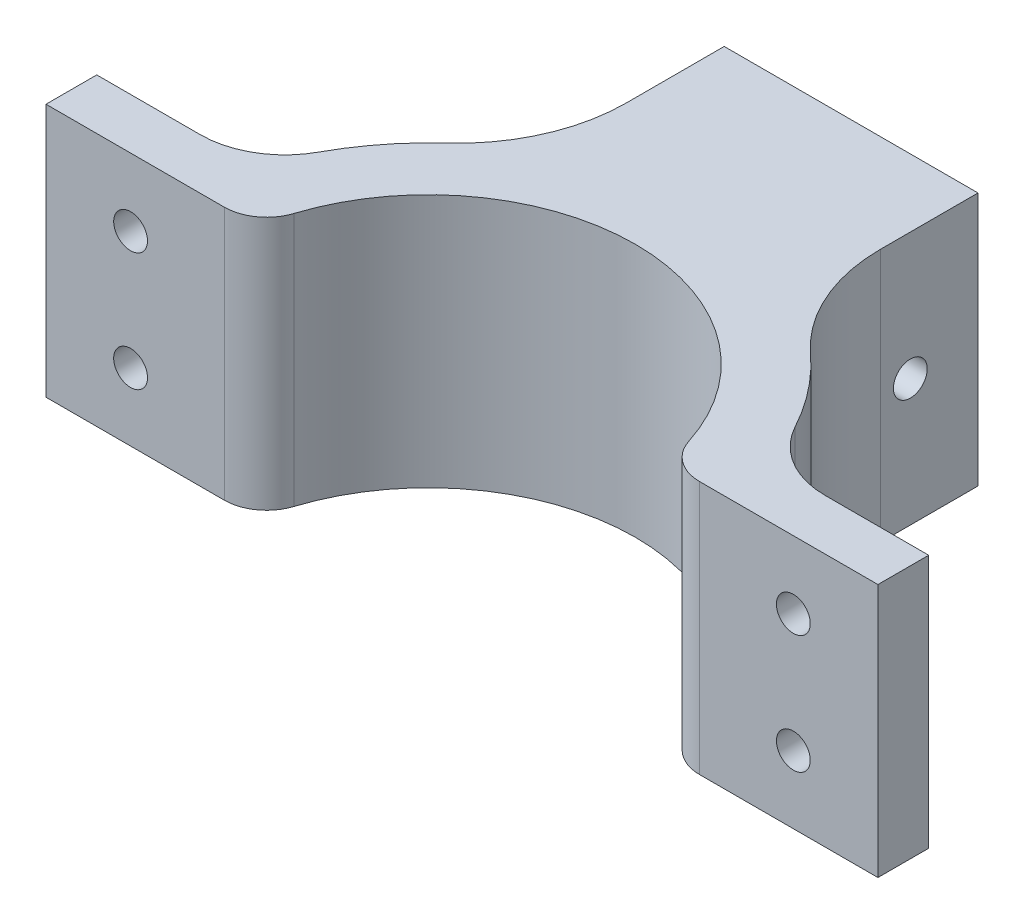
ISO-10303-21;
HEADER;
FILE_DESCRIPTION(('STEP AP214'),'2;1');
FILE_NAME('part.step','',(''),(''),'','','');
FILE_SCHEMA(('AUTOMOTIVE_DESIGN { 1 0 10303 214 1 1 1 1 }'));
ENDSEC;
DATA;
#1=APPLICATION_CONTEXT('core data for automotive mechanical design processes');
#2=APPLICATION_PROTOCOL_DEFINITION('international standard','automotive_design',2000,#1);
#3=PRODUCT_CONTEXT('',#1,'mechanical');
#4=PRODUCT('Part','Part','',(#3));
#5=PRODUCT_RELATED_PRODUCT_CATEGORY('part','',(#4));
#6=PRODUCT_DEFINITION_FORMATION('','',#4);
#7=PRODUCT_DEFINITION_CONTEXT('part definition',#1,'design');
#8=PRODUCT_DEFINITION('design','',#6,#7);
#9=PRODUCT_DEFINITION_SHAPE('','',#8);
#10=(LENGTH_UNIT() NAMED_UNIT(*) SI_UNIT(.MILLI.,.METRE.));
#11=(NAMED_UNIT(*) PLANE_ANGLE_UNIT() SI_UNIT($,.RADIAN.));
#12=(NAMED_UNIT(*) SI_UNIT($,.STERADIAN.) SOLID_ANGLE_UNIT());
#13=UNCERTAINTY_MEASURE_WITH_UNIT(LENGTH_MEASURE(1.E-05),#10,'distance_accuracy_value','');
#14=(GEOMETRIC_REPRESENTATION_CONTEXT(3) GLOBAL_UNCERTAINTY_ASSIGNED_CONTEXT((#13)) GLOBAL_UNIT_ASSIGNED_CONTEXT((#10,
#11,#12)) REPRESENTATION_CONTEXT('',''));
#15=CARTESIAN_POINT('',(0.,0.,0.));
#16=DIRECTION('',(0.,0.,1.));
#17=DIRECTION('',(1.,0.,0.));
#18=AXIS2_PLACEMENT_3D('',#15,#16,#17);
#19=CARTESIAN_POINT('',(0.,30.,0.));
#20=DIRECTION('',(0.,-1.,0.));
#21=DIRECTION('',(0.,0.,-1.));
#22=AXIS2_PLACEMENT_3D('',#19,#20,#21);
#23=CYLINDRICAL_SURFACE('',#22,32.);
#24=CARTESIAN_POINT('',(0.,30.,0.));
#25=DIRECTION('',(0.,1.,0.));
#26=DIRECTION('',(0.,0.,1.));
#27=AXIS2_PLACEMENT_3D('',#24,#25,#26);
#28=CIRCLE('',#27,32.);
#29=CARTESIAN_POINT('',(-21.5384615384615,30.,-23.6663194129593));
#30=VERTEX_POINT('',#29);
#31=CARTESIAN_POINT('',(-28.138949047801,30.,-15.2380952380952));
#32=VERTEX_POINT('',#31);
#33=EDGE_CURVE('E281',#30,#32,#28,.T.);
#34=ORIENTED_EDGE('',*,*,#33,.F.);
#35=DIRECTION('',(0.,-1.,0.));
#36=VECTOR('',#35,1.);
#37=CARTESIAN_POINT('',(-21.5384615384615,30.,-23.6663194129593));
#38=LINE('',#37,#36);
#39=CARTESIAN_POINT('',(-21.5384615384615,0.,-23.6663194129593));
#40=VERTEX_POINT('',#39);
#41=EDGE_CURVE('E62',#30,#40,#38,.T.);
#42=ORIENTED_EDGE('',*,*,#41,.T.);
#43=CARTESIAN_POINT('',(0.,0.,0.));
#44=DIRECTION('',(0.,1.,0.));
#45=DIRECTION('',(0.,0.,1.));
#46=AXIS2_PLACEMENT_3D('',#43,#44,#45);
#47=CIRCLE('',#46,32.);
#48=CARTESIAN_POINT('',(-28.138949047801,0.,-15.2380952380952));
#49=VERTEX_POINT('',#48);
#50=EDGE_CURVE('E302',#40,#49,#47,.T.);
#51=ORIENTED_EDGE('',*,*,#50,.T.);
#52=DIRECTION('',(0.,-1.,0.));
#53=VECTOR('',#52,1.);
#54=CARTESIAN_POINT('',(-28.138949047801,30.,-15.2380952380952));
#55=LINE('',#54,#53);
#56=EDGE_CURVE('E323',#49,#32,#55,.F.);
#57=ORIENTED_EDGE('',*,*,#56,.T.);
#58=EDGE_LOOP('',(#34,#42,#51,#57));
#59=FACE_BOUND('',#58,.T.);
#60=ADVANCED_FACE('F41',(#59),#23,.T.);
#61=CARTESIAN_POINT('',(28.138949047801,0.,-15.2380952380952));
#62=VERTEX_POINT('',#61);
#63=CARTESIAN_POINT('',(21.5384615384615,0.,-23.6663194129593));
#64=VERTEX_POINT('',#63);
#65=EDGE_CURVE('E303',#62,#64,#47,.T.);
#66=ORIENTED_EDGE('',*,*,#65,.T.);
#67=DIRECTION('',(0.,-1.,0.));
#68=VECTOR('',#67,1.);
#69=CARTESIAN_POINT('',(21.5384615384615,30.,-23.6663194129593));
#70=LINE('',#69,#68);
#71=CARTESIAN_POINT('',(21.5384615384615,30.,-23.6663194129593));
#72=VERTEX_POINT('',#71);
#73=EDGE_CURVE('E373',#64,#72,#70,.F.);
#74=ORIENTED_EDGE('',*,*,#73,.T.);
#75=CARTESIAN_POINT('',(28.138949047801,30.,-15.2380952380952));
#76=VERTEX_POINT('',#75);
#77=EDGE_CURVE('E282',#76,#72,#28,.T.);
#78=ORIENTED_EDGE('',*,*,#77,.F.);
#79=DIRECTION('',(0.,-1.,0.));
#80=VECTOR('',#79,1.);
#81=CARTESIAN_POINT('',(28.138949047801,30.,-15.2380952380952));
#82=LINE('',#81,#80);
#83=EDGE_CURVE('E326',#76,#62,#82,.T.);
#84=ORIENTED_EDGE('',*,*,#83,.T.);
#85=EDGE_LOOP('',(#66,#74,#78,#84));
#86=FACE_BOUND('',#85,.T.);
#87=ADVANCED_FACE('F399',(#86),#23,.T.);
#88=CARTESIAN_POINT('',(0.,30.,0.));
#89=DIRECTION('',(0.,-1.,0.));
#90=DIRECTION('',(0.,0.,-1.));
#91=AXIS2_PLACEMENT_3D('',#88,#89,#90);
#92=CYLINDRICAL_SURFACE('',#91,24.5);
#93=CARTESIAN_POINT('',(0.,30.,0.));
#94=DIRECTION('',(0.,1.,0.));
#95=DIRECTION('',(0.,0.,1.));
#96=AXIS2_PLACEMENT_3D('',#93,#94,#95);
#97=CIRCLE('',#96,24.5);
#98=CARTESIAN_POINT('',(23.3319675459704,30.,-7.47457627118644));
#99=VERTEX_POINT('',#98);
#100=CARTESIAN_POINT('',(-23.3319675459704,30.,-7.47457627118644));
#101=VERTEX_POINT('',#100);
#102=EDGE_CURVE('E270',#99,#101,#97,.T.);
#103=ORIENTED_EDGE('',*,*,#102,.T.);
#104=DIRECTION('',(0.,-1.,0.));
#105=VECTOR('',#104,1.);
#106=CARTESIAN_POINT('',(-23.3319675459704,30.,-7.47457627118644));
#107=LINE('',#106,#105);
#108=CARTESIAN_POINT('',(-23.3319675459704,0.,-7.47457627118644));
#109=VERTEX_POINT('',#108);
#110=EDGE_CURVE('E345',#101,#109,#107,.T.);
#111=ORIENTED_EDGE('',*,*,#110,.T.);
#112=CARTESIAN_POINT('',(0.,0.,0.));
#113=DIRECTION('',(0.,1.,0.));
#114=DIRECTION('',(0.,0.,1.));
#115=AXIS2_PLACEMENT_3D('',#112,#113,#114);
#116=CIRCLE('',#115,24.5);
#117=CARTESIAN_POINT('',(23.3319675459704,0.,-7.47457627118644));
#118=VERTEX_POINT('',#117);
#119=EDGE_CURVE('E267',#118,#109,#116,.T.);
#120=ORIENTED_EDGE('',*,*,#119,.F.);
#121=DIRECTION('',(0.,-1.,0.));
#122=VECTOR('',#121,1.);
#123=CARTESIAN_POINT('',(23.3319675459704,30.,-7.47457627118644));
#124=LINE('',#123,#122);
#125=EDGE_CURVE('E343',#118,#99,#124,.F.);
#126=ORIENTED_EDGE('',*,*,#125,.T.);
#127=EDGE_LOOP('',(#103,#111,#120,#126));
#128=FACE_BOUND('',#127,.T.);
#129=ADVANCED_FACE('F427',(#128),#92,.F.);
#130=CARTESIAN_POINT('',(0.,30.,-4.));
#131=DIRECTION('',(0.,0.,-1.));
#132=DIRECTION('',(-1.,0.,0.));
#133=AXIS2_PLACEMENT_3D('',#130,#131,#132);
#134=PLANE('',#133);
#135=CARTESIAN_POINT('',(39.1712639305436,8.,-3.99999999999997));
#136=DIRECTION('',(0.,0.,-1.));
#137=DIRECTION('',(-1.,0.,0.));
#138=AXIS2_PLACEMENT_3D('',#135,#136,#137);
#139=CIRCLE('',#138,2.);
#140=CARTESIAN_POINT('',(37.1712639305436,8.,-3.99999999999997));
#141=VERTEX_POINT('',#140);
#142=EDGE_CURVE('E246',#141,#141,#139,.T.);
#143=ORIENTED_EDGE('',*,*,#142,.T.);
#144=EDGE_LOOP('',(#143));
#145=FACE_BOUND('',#144,.T.);
#146=CARTESIAN_POINT('',(39.1712639305436,22.,-3.99999999999997));
#147=DIRECTION('',(0.,0.,-1.));
#148=DIRECTION('',(-1.,0.,0.));
#149=AXIS2_PLACEMENT_3D('',#146,#147,#148);
#150=CIRCLE('',#149,2.);
#151=CARTESIAN_POINT('',(37.1712639305436,22.,-3.99999999999997));
#152=VERTEX_POINT('',#151);
#153=EDGE_CURVE('E264',#152,#152,#150,.T.);
#154=ORIENTED_EDGE('',*,*,#153,.T.);
#155=EDGE_LOOP('',(#154));
#156=FACE_BOUND('',#155,.T.);
#157=DIRECTION('',(1.,0.,0.));
#158=VECTOR('',#157,1.);
#159=CARTESIAN_POINT('',(0.,30.,-4.));
#160=LINE('',#159,#158);
#161=CARTESIAN_POINT('',(28.0935935757603,30.,-4.));
#162=VERTEX_POINT('',#161);
#163=CARTESIAN_POINT('',(49.1712639305436,30.,-3.99999999999999));
#164=VERTEX_POINT('',#163);
#165=EDGE_CURVE('E273',#162,#164,#160,.T.);
#166=ORIENTED_EDGE('',*,*,#165,.F.);
#167=DIRECTION('',(0.,1.,0.));
#168=VECTOR('',#167,1.);
#169=CARTESIAN_POINT('',(28.0935935757603,0.,-4.));
#170=LINE('',#169,#168);
#171=CARTESIAN_POINT('',(28.0935935757603,0.,-4.));
#172=VERTEX_POINT('',#171);
#173=EDGE_CURVE('E358',#162,#172,#170,.F.);
#174=ORIENTED_EDGE('',*,*,#173,.T.);
#175=DIRECTION('',(1.,0.,0.));
#176=VECTOR('',#175,1.);
#177=CARTESIAN_POINT('',(0.,0.,-4.));
#178=LINE('',#177,#176);
#179=CARTESIAN_POINT('',(49.1712639305436,0.,-3.99999999999999));
#180=VERTEX_POINT('',#179);
#181=EDGE_CURVE('E295',#172,#180,#178,.T.);
#182=ORIENTED_EDGE('',*,*,#181,.T.);
#183=DIRECTION('',(0.,-1.,0.));
#184=VECTOR('',#183,1.);
#185=CARTESIAN_POINT('',(49.1712639305436,30.,-3.99999999999999));
#186=LINE('',#185,#184);
#187=EDGE_CURVE('E320',#164,#180,#186,.T.);
#188=ORIENTED_EDGE('',*,*,#187,.F.);
#189=EDGE_LOOP('',(#166,#174,#182,#188));
#190=FACE_BOUND('',#189,.T.);
#191=ADVANCED_FACE('F419',(#145,#156,#190),#134,.F.);
#192=CARTESIAN_POINT('',(49.1712639305436,30.,0.));
#193=DIRECTION('',(-1.,0.,0.));
#194=DIRECTION('',(0.,0.,1.));
#195=AXIS2_PLACEMENT_3D('',#192,#193,#194);
#196=PLANE('',#195);
#197=DIRECTION('',(0.,0.,-1.));
#198=VECTOR('',#197,1.);
#199=CARTESIAN_POINT('',(49.1712639305436,0.,0.));
#200=LINE('',#199,#198);
#201=CARTESIAN_POINT('',(49.1712639305436,0.,-9.99999999999999));
#202=VERTEX_POINT('',#201);
#203=EDGE_CURVE('E297',#180,#202,#200,.T.);
#204=ORIENTED_EDGE('',*,*,#203,.T.);
#205=DIRECTION('',(0.,-1.,0.));
#206=VECTOR('',#205,1.);
#207=CARTESIAN_POINT('',(49.1712639305436,30.,-9.99999999999999));
#208=LINE('',#207,#206);
#209=CARTESIAN_POINT('',(49.1712639305436,30.,-9.99999999999999));
#210=VERTEX_POINT('',#209);
#211=EDGE_CURVE('E317',#210,#202,#208,.T.);
#212=ORIENTED_EDGE('',*,*,#211,.F.);
#213=DIRECTION('',(0.,0.,-1.));
#214=VECTOR('',#213,1.);
#215=CARTESIAN_POINT('',(49.1712639305436,30.,0.));
#216=LINE('',#215,#214);
#217=EDGE_CURVE('E276',#164,#210,#216,.T.);
#218=ORIENTED_EDGE('',*,*,#217,.F.);
#219=ORIENTED_EDGE('',*,*,#187,.T.);
#220=EDGE_LOOP('',(#204,#212,#218,#219));
#221=FACE_BOUND('',#220,.T.);
#222=ADVANCED_FACE('F413',(#221),#196,.F.);
#223=CARTESIAN_POINT('',(0.,30.,-10.));
#224=DIRECTION('',(0.,0.,-1.));
#225=DIRECTION('',(-1.,0.,0.));
#226=AXIS2_PLACEMENT_3D('',#223,#224,#225);
#227=PLANE('',#226);
#228=CARTESIAN_POINT('',(39.1712639305436,8.,-9.99999999999999));
#229=DIRECTION('',(0.,0.,-1.));
#230=DIRECTION('',(-1.,0.,0.));
#231=AXIS2_PLACEMENT_3D('',#228,#229,#230);
#232=CIRCLE('',#231,2.);
#233=CARTESIAN_POINT('',(37.1712639305436,8.,-9.99999999999999));
#234=VERTEX_POINT('',#233);
#235=EDGE_CURVE('E250',#234,#234,#232,.T.);
#236=ORIENTED_EDGE('',*,*,#235,.F.);
#237=EDGE_LOOP('',(#236));
#238=FACE_BOUND('',#237,.T.);
#239=CARTESIAN_POINT('',(39.1712639305436,22.,-9.99999999999999));
#240=DIRECTION('',(0.,0.,-1.));
#241=DIRECTION('',(-1.,0.,0.));
#242=AXIS2_PLACEMENT_3D('',#239,#240,#241);
#243=CIRCLE('',#242,2.);
#244=CARTESIAN_POINT('',(37.1712639305436,22.,-9.99999999999999));
#245=VERTEX_POINT('',#244);
#246=EDGE_CURVE('E249',#245,#245,#243,.T.);
#247=ORIENTED_EDGE('',*,*,#246,.F.);
#248=EDGE_LOOP('',(#247));
#249=FACE_BOUND('',#248,.T.);
#250=DIRECTION('',(1.,0.,0.));
#251=VECTOR('',#250,1.);
#252=CARTESIAN_POINT('',(0.,0.,-10.));
#253=LINE('',#252,#251);
#254=CARTESIAN_POINT('',(36.9323706252388,0.,-9.99999999999999));
#255=VERTEX_POINT('',#254);
#256=EDGE_CURVE('E300',#255,#202,#253,.T.);
#257=ORIENTED_EDGE('',*,*,#256,.F.);
#258=DIRECTION('',(0.,-1.,0.));
#259=VECTOR('',#258,1.);
#260=CARTESIAN_POINT('',(36.9323706252388,30.,-9.99999999999999));
#261=LINE('',#260,#259);
#262=CARTESIAN_POINT('',(36.9323706252388,30.,-9.99999999999999));
#263=VERTEX_POINT('',#262);
#264=EDGE_CURVE('E329',#255,#263,#261,.F.);
#265=ORIENTED_EDGE('',*,*,#264,.T.);
#266=DIRECTION('',(1.,0.,0.));
#267=VECTOR('',#266,1.);
#268=CARTESIAN_POINT('',(0.,30.,-10.));
#269=LINE('',#268,#267);
#270=EDGE_CURVE('E279',#263,#210,#269,.T.);
#271=ORIENTED_EDGE('',*,*,#270,.T.);
#272=ORIENTED_EDGE('',*,*,#211,.T.);
#273=EDGE_LOOP('',(#257,#265,#271,#272));
#274=FACE_BOUND('',#273,.T.);
#275=ADVANCED_FACE('F408',(#238,#249,#274),#227,.T.);
#276=CARTESIAN_POINT('',(0.,30.,-10.));
#277=DIRECTION('',(0.,0.,1.));
#278=DIRECTION('',(1.,0.,0.));
#279=AXIS2_PLACEMENT_3D('',#276,#277,#278);
#280=PLANE('',#279);
#281=CARTESIAN_POINT('',(-39.1712639305436,22.,-10.));
#282=DIRECTION('',(0.,0.,-1.));
#283=DIRECTION('',(1.,0.,0.));
#284=AXIS2_PLACEMENT_3D('',#281,#282,#283);
#285=CIRCLE('',#284,2.);
#286=CARTESIAN_POINT('',(-37.1712639305436,22.,-10.));
#287=VERTEX_POINT('',#286);
#288=EDGE_CURVE('E245',#287,#287,#285,.T.);
#289=ORIENTED_EDGE('',*,*,#288,.F.);
#290=EDGE_LOOP('',(#289));
#291=FACE_BOUND('',#290,.T.);
#292=CARTESIAN_POINT('',(-39.1712639305436,8.,-10.));
#293=DIRECTION('',(0.,0.,-1.));
#294=DIRECTION('',(1.,0.,0.));
#295=AXIS2_PLACEMENT_3D('',#292,#293,#294);
#296=CIRCLE('',#295,2.);
#297=CARTESIAN_POINT('',(-37.1712639305436,8.,-10.));
#298=VERTEX_POINT('',#297);
#299=EDGE_CURVE('E256',#298,#298,#296,.T.);
#300=ORIENTED_EDGE('',*,*,#299,.F.);
#301=EDGE_LOOP('',(#300));
#302=FACE_BOUND('',#301,.T.);
#303=DIRECTION('',(-1.,0.,0.));
#304=VECTOR('',#303,1.);
#305=CARTESIAN_POINT('',(0.,30.,-10.));
#306=LINE('',#305,#304);
#307=CARTESIAN_POINT('',(-36.9323706252388,30.,-9.99999999999999));
#308=VERTEX_POINT('',#307);
#309=CARTESIAN_POINT('',(-49.1712639305436,30.,-9.99999999999999));
#310=VERTEX_POINT('',#309);
#311=EDGE_CURVE('E285',#308,#310,#306,.T.);
#312=ORIENTED_EDGE('',*,*,#311,.F.);
#313=DIRECTION('',(0.,1.,0.));
#314=VECTOR('',#313,1.);
#315=CARTESIAN_POINT('',(-36.9323706252388,0.,-9.99999999999999));
#316=LINE('',#315,#314);
#317=CARTESIAN_POINT('',(-36.9323706252388,0.,-9.99999999999999));
#318=VERTEX_POINT('',#317);
#319=EDGE_CURVE('E331',#308,#318,#316,.F.);
#320=ORIENTED_EDGE('',*,*,#319,.T.);
#321=DIRECTION('',(-1.,0.,0.));
#322=VECTOR('',#321,1.);
#323=CARTESIAN_POINT('',(0.,0.,-10.));
#324=LINE('',#323,#322);
#325=CARTESIAN_POINT('',(-49.1712639305436,0.,-9.99999999999999));
#326=VERTEX_POINT('',#325);
#327=EDGE_CURVE('E306',#318,#326,#324,.T.);
#328=ORIENTED_EDGE('',*,*,#327,.T.);
#329=DIRECTION('',(0.,-1.,0.));
#330=VECTOR('',#329,1.);
#331=CARTESIAN_POINT('',(-49.1712639305436,30.,-9.99999999999999));
#332=LINE('',#331,#330);
#333=EDGE_CURVE('E314',#310,#326,#332,.T.);
#334=ORIENTED_EDGE('',*,*,#333,.F.);
#335=EDGE_LOOP('',(#312,#320,#328,#334));
#336=FACE_BOUND('',#335,.T.);
#337=ADVANCED_FACE('F447',(#291,#302,#336),#280,.F.);
#338=CARTESIAN_POINT('',(-49.1712639305436,30.,0.));
#339=DIRECTION('',(-1.,0.,0.));
#340=DIRECTION('',(0.,0.,1.));
#341=AXIS2_PLACEMENT_3D('',#338,#339,#340);
#342=PLANE('',#341);
#343=DIRECTION('',(0.,0.,-1.));
#344=VECTOR('',#343,1.);
#345=CARTESIAN_POINT('',(-49.1712639305436,0.,0.));
#346=LINE('',#345,#344);
#347=CARTESIAN_POINT('',(-49.1712639305436,0.,-3.99999999999999));
#348=VERTEX_POINT('',#347);
#349=EDGE_CURVE('E308',#348,#326,#346,.T.);
#350=ORIENTED_EDGE('',*,*,#349,.F.);
#351=DIRECTION('',(0.,-1.,0.));
#352=VECTOR('',#351,1.);
#353=CARTESIAN_POINT('',(-49.1712639305436,30.,-3.99999999999999));
#354=LINE('',#353,#352);
#355=CARTESIAN_POINT('',(-49.1712639305436,30.,-3.99999999999999));
#356=VERTEX_POINT('',#355);
#357=EDGE_CURVE('E292',#356,#348,#354,.T.);
#358=ORIENTED_EDGE('',*,*,#357,.F.);
#359=DIRECTION('',(0.,0.,-1.));
#360=VECTOR('',#359,1.);
#361=CARTESIAN_POINT('',(-49.1712639305436,30.,0.));
#362=LINE('',#361,#360);
#363=EDGE_CURVE('E287',#356,#310,#362,.T.);
#364=ORIENTED_EDGE('',*,*,#363,.T.);
#365=ORIENTED_EDGE('',*,*,#333,.T.);
#366=EDGE_LOOP('',(#350,#358,#364,#365));
#367=FACE_BOUND('',#366,.T.);
#368=ADVANCED_FACE('F441',(#367),#342,.T.);
#369=CARTESIAN_POINT('',(0.,30.,-4.));
#370=DIRECTION('',(0.,0.,1.));
#371=DIRECTION('',(1.,0.,0.));
#372=AXIS2_PLACEMENT_3D('',#369,#370,#371);
#373=PLANE('',#372);
#374=CARTESIAN_POINT('',(-39.1712639305436,22.,-3.99999999999999));
#375=DIRECTION('',(0.,0.,-1.));
#376=DIRECTION('',(1.,0.,0.));
#377=AXIS2_PLACEMENT_3D('',#374,#375,#376);
#378=CIRCLE('',#377,2.);
#379=CARTESIAN_POINT('',(-37.1712639305436,22.,-3.99999999999999));
#380=VERTEX_POINT('',#379);
#381=EDGE_CURVE('E259',#380,#380,#378,.T.);
#382=ORIENTED_EDGE('',*,*,#381,.T.);
#383=EDGE_LOOP('',(#382));
#384=FACE_BOUND('',#383,.T.);
#385=CARTESIAN_POINT('',(-39.1712639305436,8.,-3.99999999999999));
#386=DIRECTION('',(0.,0.,-1.));
#387=DIRECTION('',(1.,0.,0.));
#388=AXIS2_PLACEMENT_3D('',#385,#386,#387);
#389=CIRCLE('',#388,2.);
#390=CARTESIAN_POINT('',(-37.1712639305436,8.,-3.99999999999999));
#391=VERTEX_POINT('',#390);
#392=EDGE_CURVE('E253',#391,#391,#389,.T.);
#393=ORIENTED_EDGE('',*,*,#392,.T.);
#394=EDGE_LOOP('',(#393));
#395=FACE_BOUND('',#394,.T.);
#396=DIRECTION('',(-1.,0.,0.));
#397=VECTOR('',#396,1.);
#398=CARTESIAN_POINT('',(0.,0.,-4.));
#399=LINE('',#398,#397);
#400=CARTESIAN_POINT('',(-28.0935935757603,0.,-4.));
#401=VERTEX_POINT('',#400);
#402=EDGE_CURVE('E274',#401,#348,#399,.T.);
#403=ORIENTED_EDGE('',*,*,#402,.F.);
#404=DIRECTION('',(0.,-1.,0.));
#405=VECTOR('',#404,1.);
#406=CARTESIAN_POINT('',(-28.0935935757603,30.,-4.));
#407=LINE('',#406,#405);
#408=CARTESIAN_POINT('',(-28.0935935757603,30.,-4.));
#409=VERTEX_POINT('',#408);
#410=EDGE_CURVE('E352',#401,#409,#407,.F.);
#411=ORIENTED_EDGE('',*,*,#410,.T.);
#412=DIRECTION('',(-1.,0.,0.));
#413=VECTOR('',#412,1.);
#414=CARTESIAN_POINT('',(0.,30.,-4.));
#415=LINE('',#414,#413);
#416=EDGE_CURVE('E290',#409,#356,#415,.T.);
#417=ORIENTED_EDGE('',*,*,#416,.T.);
#418=ORIENTED_EDGE('',*,*,#357,.T.);
#419=EDGE_LOOP('',(#403,#411,#417,#418));
#420=FACE_BOUND('',#419,.T.);
#421=ADVANCED_FACE('F437',(#384,#395,#420),#373,.T.);
#422=CARTESIAN_POINT('',(0.,30.,0.));
#423=DIRECTION('',(0.,1.,0.));
#424=DIRECTION('',(0.,0.,1.));
#425=AXIS2_PLACEMENT_3D('',#422,#423,#424);
#426=PLANE('',#425);
#427=ORIENTED_EDGE('',*,*,#77,.T.);
#428=CARTESIAN_POINT('',(35.,30.,-38.4577690460588));
#429=DIRECTION('',(0.,1.,0.));
#430=DIRECTION('',(0.,0.,1.));
#431=AXIS2_PLACEMENT_3D('',#428,#429,#430);
#432=CIRCLE('',#431,20.);
#433=CARTESIAN_POINT('',(15.,30.,-38.4577690460588));
#434=VERTEX_POINT('',#433);
#435=EDGE_CURVE('E381',#72,#434,#432,.F.);
#436=ORIENTED_EDGE('',*,*,#435,.T.);
#437=DIRECTION('',(0.,0.,1.));
#438=VECTOR('',#437,1.);
#439=CARTESIAN_POINT('',(15.,30.,-50.));
#440=LINE('',#439,#438);
#441=CARTESIAN_POINT('',(15.,30.,-50.));
#442=VERTEX_POINT('',#441);
#443=EDGE_CURVE('E240',#442,#434,#440,.T.);
#444=ORIENTED_EDGE('',*,*,#443,.F.);
#445=DIRECTION('',(1.,0.,0.));
#446=VECTOR('',#445,1.);
#447=CARTESIAN_POINT('',(15.,30.,-50.));
#448=LINE('',#447,#446);
#449=CARTESIAN_POINT('',(-15.,30.,-50.));
#450=VERTEX_POINT('',#449);
#451=EDGE_CURVE('E228',#450,#442,#448,.T.);
#452=ORIENTED_EDGE('',*,*,#451,.F.);
#453=DIRECTION('',(0.,0.,1.));
#454=VECTOR('',#453,1.);
#455=CARTESIAN_POINT('',(-15.,30.,-50.));
#456=LINE('',#455,#454);
#457=CARTESIAN_POINT('',(-15.,30.,-38.4577690460588));
#458=VERTEX_POINT('',#457);
#459=EDGE_CURVE('E243',#450,#458,#456,.T.);
#460=ORIENTED_EDGE('',*,*,#459,.T.);
#461=CARTESIAN_POINT('',(-35.,30.,-38.4577690460588));
#462=DIRECTION('',(0.,1.,0.));
#463=DIRECTION('',(0.,0.,1.));
#464=AXIS2_PLACEMENT_3D('',#461,#462,#463);
#465=CIRCLE('',#464,20.);
#466=EDGE_CURVE('E49',#458,#30,#465,.F.);
#467=ORIENTED_EDGE('',*,*,#466,.T.);
#468=ORIENTED_EDGE('',*,*,#33,.T.);
#469=CARTESIAN_POINT('',(-36.9323706252388,30.,-20.));
#470=DIRECTION('',(0.,1.,0.));
#471=DIRECTION('',(0.,0.,1.));
#472=AXIS2_PLACEMENT_3D('',#469,#470,#471);
#473=CIRCLE('',#472,10.);
#474=EDGE_CURVE('E341',#32,#308,#473,.F.);
#475=ORIENTED_EDGE('',*,*,#474,.T.);
#476=ORIENTED_EDGE('',*,*,#311,.T.);
#477=ORIENTED_EDGE('',*,*,#363,.F.);
#478=ORIENTED_EDGE('',*,*,#416,.F.);
#479=CARTESIAN_POINT('',(-28.0935935757603,30.,-9.));
#480=DIRECTION('',(0.,1.,0.));
#481=DIRECTION('',(0.,0.,1.));
#482=AXIS2_PLACEMENT_3D('',#479,#480,#481);
#483=CIRCLE('',#482,5.);
#484=EDGE_CURVE('E356',#409,#101,#483,.T.);
#485=ORIENTED_EDGE('',*,*,#484,.T.);
#486=ORIENTED_EDGE('',*,*,#102,.F.);
#487=CARTESIAN_POINT('',(28.0935935757603,30.,-9.));
#488=DIRECTION('',(0.,1.,0.));
#489=DIRECTION('',(0.,0.,1.));
#490=AXIS2_PLACEMENT_3D('',#487,#488,#489);
#491=CIRCLE('',#490,5.);
#492=EDGE_CURVE('E354',#99,#162,#491,.T.);
#493=ORIENTED_EDGE('',*,*,#492,.T.);
#494=ORIENTED_EDGE('',*,*,#165,.T.);
#495=ORIENTED_EDGE('',*,*,#217,.T.);
#496=ORIENTED_EDGE('',*,*,#270,.F.);
#497=CARTESIAN_POINT('',(36.9323706252388,30.,-20.));
#498=DIRECTION('',(0.,1.,0.));
#499=DIRECTION('',(0.,0.,1.));
#500=AXIS2_PLACEMENT_3D('',#497,#498,#499);
#501=CIRCLE('',#500,10.);
#502=EDGE_CURVE('E336',#263,#76,#501,.F.);
#503=ORIENTED_EDGE('',*,*,#502,.T.);
#504=EDGE_LOOP('',(#427,#436,#444,#452,#460,#467,#468,#475,#476,#477,#478,#485,#486,#493,#494,
#495,#496,#503));
#505=FACE_BOUND('',#504,.T.);
#506=ADVANCED_FACE('F384',(#505),#426,.T.);
#507=CARTESIAN_POINT('',(0.,0.,0.));
#508=DIRECTION('',(0.,1.,0.));
#509=DIRECTION('',(0.,0.,1.));
#510=AXIS2_PLACEMENT_3D('',#507,#508,#509);
#511=PLANE('',#510);
#512=ORIENTED_EDGE('',*,*,#50,.F.);
#513=CARTESIAN_POINT('',(-35.,0.,-38.4577690460588));
#514=DIRECTION('',(0.,1.,0.));
#515=DIRECTION('',(0.,0.,1.));
#516=AXIS2_PLACEMENT_3D('',#513,#514,#515);
#517=CIRCLE('',#516,20.);
#518=CARTESIAN_POINT('',(-15.,0.,-38.4577690460588));
#519=VERTEX_POINT('',#518);
#520=EDGE_CURVE('E11',#40,#519,#517,.T.);
#521=ORIENTED_EDGE('',*,*,#520,.T.);
#522=DIRECTION('',(0.,0.,1.));
#523=VECTOR('',#522,1.);
#524=CARTESIAN_POINT('',(-15.,0.,-50.));
#525=LINE('',#524,#523);
#526=CARTESIAN_POINT('',(-15.,0.,-50.));
#527=VERTEX_POINT('',#526);
#528=EDGE_CURVE('E234',#527,#519,#525,.T.);
#529=ORIENTED_EDGE('',*,*,#528,.F.);
#530=DIRECTION('',(-1.,0.,0.));
#531=VECTOR('',#530,1.);
#532=CARTESIAN_POINT('',(15.,0.,-50.));
#533=LINE('',#532,#531);
#534=CARTESIAN_POINT('',(15.,0.,-50.));
#535=VERTEX_POINT('',#534);
#536=EDGE_CURVE('E232',#535,#527,#533,.T.);
#537=ORIENTED_EDGE('',*,*,#536,.F.);
#538=DIRECTION('',(0.,0.,1.));
#539=VECTOR('',#538,1.);
#540=CARTESIAN_POINT('',(15.,0.,-50.));
#541=LINE('',#540,#539);
#542=CARTESIAN_POINT('',(15.,0.,-38.4577690460588));
#543=VERTEX_POINT('',#542);
#544=EDGE_CURVE('E237',#535,#543,#541,.T.);
#545=ORIENTED_EDGE('',*,*,#544,.T.);
#546=CARTESIAN_POINT('',(35.,0.,-38.4577690460588));
#547=DIRECTION('',(0.,1.,0.));
#548=DIRECTION('',(0.,0.,1.));
#549=AXIS2_PLACEMENT_3D('',#546,#547,#548);
#550=CIRCLE('',#549,20.);
#551=EDGE_CURVE('E379',#543,#64,#550,.T.);
#552=ORIENTED_EDGE('',*,*,#551,.T.);
#553=ORIENTED_EDGE('',*,*,#65,.F.);
#554=CARTESIAN_POINT('',(36.9323706252388,0.,-20.));
#555=DIRECTION('',(0.,1.,0.));
#556=DIRECTION('',(0.,0.,1.));
#557=AXIS2_PLACEMENT_3D('',#554,#555,#556);
#558=CIRCLE('',#557,10.);
#559=EDGE_CURVE('E334',#62,#255,#558,.T.);
#560=ORIENTED_EDGE('',*,*,#559,.T.);
#561=ORIENTED_EDGE('',*,*,#256,.T.);
#562=ORIENTED_EDGE('',*,*,#203,.F.);
#563=ORIENTED_EDGE('',*,*,#181,.F.);
#564=CARTESIAN_POINT('',(28.0935935757603,0.,-9.));
#565=DIRECTION('',(0.,1.,0.));
#566=DIRECTION('',(0.,0.,1.));
#567=AXIS2_PLACEMENT_3D('',#564,#565,#566);
#568=CIRCLE('',#567,5.);
#569=EDGE_CURVE('E348',#172,#118,#568,.F.);
#570=ORIENTED_EDGE('',*,*,#569,.T.);
#571=ORIENTED_EDGE('',*,*,#119,.T.);
#572=CARTESIAN_POINT('',(-28.0935935757603,0.,-9.));
#573=DIRECTION('',(0.,1.,0.));
#574=DIRECTION('',(0.,0.,1.));
#575=AXIS2_PLACEMENT_3D('',#572,#573,#574);
#576=CIRCLE('',#575,5.);
#577=EDGE_CURVE('E350',#109,#401,#576,.F.);
#578=ORIENTED_EDGE('',*,*,#577,.T.);
#579=ORIENTED_EDGE('',*,*,#402,.T.);
#580=ORIENTED_EDGE('',*,*,#349,.T.);
#581=ORIENTED_EDGE('',*,*,#327,.F.);
#582=CARTESIAN_POINT('',(-36.9323706252388,0.,-20.));
#583=DIRECTION('',(0.,1.,0.));
#584=DIRECTION('',(0.,0.,1.));
#585=AXIS2_PLACEMENT_3D('',#582,#583,#584);
#586=CIRCLE('',#585,10.);
#587=EDGE_CURVE('E338',#318,#49,#586,.T.);
#588=ORIENTED_EDGE('',*,*,#587,.T.);
#589=EDGE_LOOP('',(#512,#521,#529,#537,#545,#552,#553,#560,#561,#562,#563,#570,#571,#578,#579,
#580,#581,#588));
#590=FACE_BOUND('',#589,.T.);
#591=ADVANCED_FACE('F396',(#590),#511,.F.);
#592=CARTESIAN_POINT('',(-39.1712639305436,8.,-3.99999999999999));
#593=DIRECTION('',(0.,0.,-1.));
#594=DIRECTION('',(-1.,0.,0.));
#595=AXIS2_PLACEMENT_3D('',#592,#593,#594);
#596=CYLINDRICAL_SURFACE('',#595,2.);
#597=ORIENTED_EDGE('',*,*,#392,.F.);
#598=EDGE_LOOP('',(#597));
#599=FACE_BOUND('',#598,.T.);
#600=ORIENTED_EDGE('',*,*,#299,.T.);
#601=EDGE_LOOP('',(#600));
#602=FACE_BOUND('',#601,.T.);
#603=ADVANCED_FACE('F660',(#599,#602),#596,.F.);
#604=CARTESIAN_POINT('',(-39.1712639305436,22.,-3.99999999999999));
#605=DIRECTION('',(0.,0.,-1.));
#606=DIRECTION('',(-1.,0.,0.));
#607=AXIS2_PLACEMENT_3D('',#604,#605,#606);
#608=CYLINDRICAL_SURFACE('',#607,2.);
#609=ORIENTED_EDGE('',*,*,#381,.F.);
#610=EDGE_LOOP('',(#609));
#611=FACE_BOUND('',#610,.T.);
#612=ORIENTED_EDGE('',*,*,#288,.T.);
#613=EDGE_LOOP('',(#612));
#614=FACE_BOUND('',#613,.T.);
#615=ADVANCED_FACE('F650',(#611,#614),#608,.F.);
#616=CARTESIAN_POINT('',(39.1712639305436,22.,-3.99999999999997));
#617=DIRECTION('',(0.,0.,-1.));
#618=DIRECTION('',(-1.,0.,0.));
#619=AXIS2_PLACEMENT_3D('',#616,#617,#618);
#620=CYLINDRICAL_SURFACE('',#619,2.);
#621=ORIENTED_EDGE('',*,*,#153,.F.);
#622=EDGE_LOOP('',(#621));
#623=FACE_BOUND('',#622,.T.);
#624=ORIENTED_EDGE('',*,*,#246,.T.);
#625=EDGE_LOOP('',(#624));
#626=FACE_BOUND('',#625,.T.);
#627=ADVANCED_FACE('F640',(#623,#626),#620,.F.);
#628=CARTESIAN_POINT('',(39.1712639305436,8.,-3.99999999999997));
#629=DIRECTION('',(0.,0.,-1.));
#630=DIRECTION('',(-1.,0.,0.));
#631=AXIS2_PLACEMENT_3D('',#628,#629,#630);
#632=CYLINDRICAL_SURFACE('',#631,2.);
#633=ORIENTED_EDGE('',*,*,#142,.F.);
#634=EDGE_LOOP('',(#633));
#635=FACE_BOUND('',#634,.T.);
#636=ORIENTED_EDGE('',*,*,#235,.T.);
#637=EDGE_LOOP('',(#636));
#638=FACE_BOUND('',#637,.T.);
#639=ADVANCED_FACE('F614',(#635,#638),#632,.F.);
#640=CARTESIAN_POINT('',(36.9323706252388,30.,-20.));
#641=DIRECTION('',(0.,-1.,0.));
#642=DIRECTION('',(0.,0.,-1.));
#643=AXIS2_PLACEMENT_3D('',#640,#641,#642);
#644=CYLINDRICAL_SURFACE('',#643,10.);
#645=ORIENTED_EDGE('',*,*,#502,.F.);
#646=ORIENTED_EDGE('',*,*,#264,.F.);
#647=ORIENTED_EDGE('',*,*,#559,.F.);
#648=ORIENTED_EDGE('',*,*,#83,.F.);
#649=EDGE_LOOP('',(#645,#646,#647,#648));
#650=FACE_BOUND('',#649,.T.);
#651=ADVANCED_FACE('F403',(#650),#644,.F.);
#652=CARTESIAN_POINT('',(-36.9323706252388,30.,-20.));
#653=DIRECTION('',(0.,-1.,0.));
#654=DIRECTION('',(0.,0.,-1.));
#655=AXIS2_PLACEMENT_3D('',#652,#653,#654);
#656=CYLINDRICAL_SURFACE('',#655,10.);
#657=ORIENTED_EDGE('',*,*,#474,.F.);
#658=ORIENTED_EDGE('',*,*,#56,.F.);
#659=ORIENTED_EDGE('',*,*,#587,.F.);
#660=ORIENTED_EDGE('',*,*,#319,.F.);
#661=EDGE_LOOP('',(#657,#658,#659,#660));
#662=FACE_BOUND('',#661,.T.);
#663=ADVANCED_FACE('F451',(#662),#656,.F.);
#664=CARTESIAN_POINT('',(-28.0935935757603,30.,-9.));
#665=DIRECTION('',(0.,-1.,0.));
#666=DIRECTION('',(0.,0.,-1.));
#667=AXIS2_PLACEMENT_3D('',#664,#665,#666);
#668=CYLINDRICAL_SURFACE('',#667,5.);
#669=ORIENTED_EDGE('',*,*,#484,.F.);
#670=ORIENTED_EDGE('',*,*,#410,.F.);
#671=ORIENTED_EDGE('',*,*,#577,.F.);
#672=ORIENTED_EDGE('',*,*,#110,.F.);
#673=EDGE_LOOP('',(#669,#670,#671,#672));
#674=FACE_BOUND('',#673,.T.);
#675=ADVANCED_FACE('F434',(#674),#668,.T.);
#676=CARTESIAN_POINT('',(28.0935935757603,30.,-9.));
#677=DIRECTION('',(0.,-1.,0.));
#678=DIRECTION('',(0.,0.,-1.));
#679=AXIS2_PLACEMENT_3D('',#676,#677,#678);
#680=CYLINDRICAL_SURFACE('',#679,5.);
#681=ORIENTED_EDGE('',*,*,#492,.F.);
#682=ORIENTED_EDGE('',*,*,#125,.F.);
#683=ORIENTED_EDGE('',*,*,#569,.F.);
#684=ORIENTED_EDGE('',*,*,#173,.F.);
#685=EDGE_LOOP('',(#681,#682,#683,#684));
#686=FACE_BOUND('',#685,.T.);
#687=ADVANCED_FACE('F423',(#686),#680,.T.);
#688=CARTESIAN_POINT('',(-9.25000000000001,5.75000000000001,-50.));
#689=DIRECTION('',(1.,0.,0.));
#690=DIRECTION('',(0.,0.,-1.));
#691=AXIS2_PLACEMENT_3D('',#688,#689,#690);
#692=PLANE('',#691);
#693=CARTESIAN_POINT('',(-9.25000000000001,15.,-42.));
#694=DIRECTION('',(1.,0.,0.));
#695=DIRECTION('',(0.,0.,-1.));
#696=AXIS2_PLACEMENT_3D('',#693,#694,#695);
#697=CIRCLE('',#696,2.);
#698=CARTESIAN_POINT('',(-9.25000000000001,15.,-44.));
#699=VERTEX_POINT('',#698);
#700=EDGE_CURVE('E200',#699,#699,#697,.T.);
#701=ORIENTED_EDGE('',*,*,#700,.F.);
#702=EDGE_LOOP('',(#701));
#703=FACE_BOUND('',#702,.T.);
#704=DIRECTION('',(0.,-1.,0.));
#705=VECTOR('',#704,1.);
#706=CARTESIAN_POINT('',(-9.25000000000001,30.,-30.6339272702669));
#707=LINE('',#706,#705);
#708=CARTESIAN_POINT('',(-9.25000000000001,5.75000000000001,-30.6339272702669));
#709=VERTEX_POINT('',#708);
#710=CARTESIAN_POINT('',(-9.25000000000001,24.25,-30.6339272702669));
#711=VERTEX_POINT('',#710);
#712=EDGE_CURVE('E368',#709,#711,#707,.F.);
#713=ORIENTED_EDGE('',*,*,#712,.F.);
#714=DIRECTION('',(0.,0.,1.));
#715=VECTOR('',#714,1.);
#716=CARTESIAN_POINT('',(-9.25000000000001,5.75000000000001,-50.));
#717=LINE('',#716,#715);
#718=CARTESIAN_POINT('',(-9.25000000000001,5.75000000000001,-50.));
#719=VERTEX_POINT('',#718);
#720=EDGE_CURVE('E195',#719,#709,#717,.T.);
#721=ORIENTED_EDGE('',*,*,#720,.F.);
#722=DIRECTION('',(0.,1.,0.));
#723=VECTOR('',#722,1.);
#724=CARTESIAN_POINT('',(-9.25000000000001,5.75000000000001,-50.));
#725=LINE('',#724,#723);
#726=CARTESIAN_POINT('',(-9.25000000000001,24.25,-50.));
#727=VERTEX_POINT('',#726);
#728=EDGE_CURVE('E189',#719,#727,#725,.T.);
#729=ORIENTED_EDGE('',*,*,#728,.T.);
#730=DIRECTION('',(0.,0.,1.));
#731=VECTOR('',#730,1.);
#732=CARTESIAN_POINT('',(-9.25000000000001,24.25,-50.));
#733=LINE('',#732,#731);
#734=EDGE_CURVE('E193',#727,#711,#733,.T.);
#735=ORIENTED_EDGE('',*,*,#734,.T.);
#736=EDGE_LOOP('',(#713,#721,#729,#735));
#737=FACE_BOUND('',#736,.T.);
#738=ADVANCED_FACE('F192',(#703,#737),#692,.T.);
#739=CARTESIAN_POINT('',(9.24999999999999,5.75000000000001,-50.));
#740=DIRECTION('',(-1.,0.,0.));
#741=DIRECTION('',(0.,0.,1.));
#742=AXIS2_PLACEMENT_3D('',#739,#740,#741);
#743=PLANE('',#742);
#744=CARTESIAN_POINT('',(9.24999999999999,15.,-42.));
#745=DIRECTION('',(-1.,0.,0.));
#746=DIRECTION('',(0.,0.,1.));
#747=AXIS2_PLACEMENT_3D('',#744,#745,#746);
#748=CIRCLE('',#747,2.);
#749=CARTESIAN_POINT('',(9.24999999999999,15.,-40.));
#750=VERTEX_POINT('',#749);
#751=EDGE_CURVE('E514',#750,#750,#748,.T.);
#752=ORIENTED_EDGE('',*,*,#751,.F.);
#753=EDGE_LOOP('',(#752));
#754=FACE_BOUND('',#753,.T.);
#755=DIRECTION('',(0.,-1.,0.));
#756=VECTOR('',#755,1.);
#757=CARTESIAN_POINT('',(9.24999999999999,30.,-30.6339272702669));
#758=LINE('',#757,#756);
#759=CARTESIAN_POINT('',(9.24999999999999,24.25,-30.6339272702669));
#760=VERTEX_POINT('',#759);
#761=CARTESIAN_POINT('',(9.24999999999999,5.75000000000001,-30.6339272702669));
#762=VERTEX_POINT('',#761);
#763=EDGE_CURVE('E364',#760,#762,#758,.T.);
#764=ORIENTED_EDGE('',*,*,#763,.F.);
#765=DIRECTION('',(0.,0.,1.));
#766=VECTOR('',#765,1.);
#767=CARTESIAN_POINT('',(9.24999999999999,24.25,-50.));
#768=LINE('',#767,#766);
#769=CARTESIAN_POINT('',(9.24999999999999,24.25,-50.));
#770=VERTEX_POINT('',#769);
#771=EDGE_CURVE('E209',#770,#760,#768,.T.);
#772=ORIENTED_EDGE('',*,*,#771,.F.);
#773=DIRECTION('',(0.,-1.,0.));
#774=VECTOR('',#773,1.);
#775=CARTESIAN_POINT('',(9.24999999999999,5.75000000000001,-50.));
#776=LINE('',#775,#774);
#777=CARTESIAN_POINT('',(9.25,5.75000000000001,-50.));
#778=VERTEX_POINT('',#777);
#779=EDGE_CURVE('E214',#770,#778,#776,.T.);
#780=ORIENTED_EDGE('',*,*,#779,.T.);
#781=DIRECTION('',(0.,0.,1.));
#782=VECTOR('',#781,1.);
#783=CARTESIAN_POINT('',(9.24999999999999,5.75000000000001,-50.));
#784=LINE('',#783,#782);
#785=EDGE_CURVE('E222',#778,#762,#784,.T.);
#786=ORIENTED_EDGE('',*,*,#785,.T.);
#787=EDGE_LOOP('',(#764,#772,#780,#786));
#788=FACE_BOUND('',#787,.T.);
#789=ADVANCED_FACE('F490',(#754,#788),#743,.T.);
#790=CARTESIAN_POINT('',(-15.,0.,-50.));
#791=DIRECTION('',(1.,0.,0.));
#792=DIRECTION('',(0.,0.,-1.));
#793=AXIS2_PLACEMENT_3D('',#790,#791,#792);
#794=PLANE('',#793);
#795=CARTESIAN_POINT('',(-15.,15.,-42.));
#796=DIRECTION('',(1.,0.,0.));
#797=DIRECTION('',(0.,0.,-1.));
#798=AXIS2_PLACEMENT_3D('',#795,#796,#797);
#799=CIRCLE('',#798,2.);
#800=CARTESIAN_POINT('',(-15.,15.,-44.));
#801=VERTEX_POINT('',#800);
#802=EDGE_CURVE('E518',#801,#801,#799,.F.);
#803=ORIENTED_EDGE('',*,*,#802,.F.);
#804=EDGE_LOOP('',(#803));
#805=FACE_BOUND('',#804,.T.);
#806=ORIENTED_EDGE('',*,*,#528,.T.);
#807=DIRECTION('',(0.,1.,0.));
#808=VECTOR('',#807,1.);
#809=CARTESIAN_POINT('',(-15.,30.,-38.4577690460588));
#810=LINE('',#809,#808);
#811=EDGE_CURVE('E375',#519,#458,#810,.T.);
#812=ORIENTED_EDGE('',*,*,#811,.T.);
#813=ORIENTED_EDGE('',*,*,#459,.F.);
#814=DIRECTION('',(0.,1.,0.));
#815=VECTOR('',#814,1.);
#816=CARTESIAN_POINT('',(-15.,0.,-50.));
#817=LINE('',#816,#815);
#818=EDGE_CURVE('E208',#527,#450,#817,.T.);
#819=ORIENTED_EDGE('',*,*,#818,.F.);
#820=EDGE_LOOP('',(#806,#812,#813,#819));
#821=FACE_BOUND('',#820,.T.);
#822=ADVANCED_FACE('F458',(#805,#821),#794,.F.);
#823=CARTESIAN_POINT('',(15.,0.,-50.));
#824=DIRECTION('',(-1.,0.,0.));
#825=DIRECTION('',(0.,0.,1.));
#826=AXIS2_PLACEMENT_3D('',#823,#824,#825);
#827=PLANE('',#826);
#828=CARTESIAN_POINT('',(15.,15.,-42.));
#829=DIRECTION('',(1.,0.,0.));
#830=DIRECTION('',(0.,0.,-1.));
#831=AXIS2_PLACEMENT_3D('',#828,#829,#830);
#832=CIRCLE('',#831,2.);
#833=CARTESIAN_POINT('',(15.,15.,-44.));
#834=VERTEX_POINT('',#833);
#835=EDGE_CURVE('E517',#834,#834,#832,.T.);
#836=ORIENTED_EDGE('',*,*,#835,.F.);
#837=EDGE_LOOP('',(#836));
#838=FACE_BOUND('',#837,.T.);
#839=ORIENTED_EDGE('',*,*,#443,.T.);
#840=DIRECTION('',(0.,1.,0.));
#841=VECTOR('',#840,1.);
#842=CARTESIAN_POINT('',(15.,0.,-38.4577690460588));
#843=LINE('',#842,#841);
#844=EDGE_CURVE('E370',#434,#543,#843,.F.);
#845=ORIENTED_EDGE('',*,*,#844,.T.);
#846=ORIENTED_EDGE('',*,*,#544,.F.);
#847=DIRECTION('',(0.,-1.,0.));
#848=VECTOR('',#847,1.);
#849=CARTESIAN_POINT('',(15.,0.,-50.));
#850=LINE('',#849,#848);
#851=EDGE_CURVE('E230',#442,#535,#850,.T.);
#852=ORIENTED_EDGE('',*,*,#851,.F.);
#853=EDGE_LOOP('',(#839,#845,#846,#852));
#854=FACE_BOUND('',#853,.T.);
#855=ADVANCED_FACE('F391',(#838,#854),#827,.F.);
#856=CARTESIAN_POINT('',(0.,0.,-50.));
#857=DIRECTION('',(0.,0.,1.));
#858=DIRECTION('',(1.,0.,0.));
#859=AXIS2_PLACEMENT_3D('',#856,#857,#858);
#860=PLANE('',#859);
#861=ORIENTED_EDGE('',*,*,#818,.T.);
#862=ORIENTED_EDGE('',*,*,#451,.T.);
#863=ORIENTED_EDGE('',*,*,#851,.T.);
#864=ORIENTED_EDGE('',*,*,#536,.T.);
#865=EDGE_LOOP('',(#861,#862,#863,#864));
#866=FACE_BOUND('',#865,.T.);
#867=ORIENTED_EDGE('',*,*,#728,.F.);
#868=DIRECTION('',(-1.,0.,0.));
#869=VECTOR('',#868,1.);
#870=CARTESIAN_POINT('',(9.24999999999999,5.75000000000001,-50.));
#871=LINE('',#870,#869);
#872=EDGE_CURVE('E216',#778,#719,#871,.T.);
#873=ORIENTED_EDGE('',*,*,#872,.F.);
#874=ORIENTED_EDGE('',*,*,#779,.F.);
#875=DIRECTION('',(1.,0.,0.));
#876=VECTOR('',#875,1.);
#877=CARTESIAN_POINT('',(9.24999999999999,24.25,-50.));
#878=LINE('',#877,#876);
#879=EDGE_CURVE('E199',#727,#770,#878,.T.);
#880=ORIENTED_EDGE('',*,*,#879,.F.);
#881=EDGE_LOOP('',(#867,#873,#874,#880));
#882=FACE_BOUND('',#881,.T.);
#883=ADVANCED_FACE('F212',(#866,#882),#860,.F.);
#884=CARTESIAN_POINT('',(9.24999999999999,24.25,-50.));
#885=DIRECTION('',(0.,-1.,0.));
#886=DIRECTION('',(0.,0.,-1.));
#887=AXIS2_PLACEMENT_3D('',#884,#885,#886);
#888=PLANE('',#887);
#889=CARTESIAN_POINT('',(0.,24.25,0.));
#890=DIRECTION('',(0.,-1.,0.));
#891=DIRECTION('',(0.,0.,-1.));
#892=AXIS2_PLACEMENT_3D('',#889,#890,#891);
#893=CIRCLE('',#892,32.);
#894=EDGE_CURVE('E207',#711,#760,#893,.T.);
#895=ORIENTED_EDGE('',*,*,#894,.F.);
#896=ORIENTED_EDGE('',*,*,#734,.F.);
#897=ORIENTED_EDGE('',*,*,#879,.T.);
#898=ORIENTED_EDGE('',*,*,#771,.T.);
#899=EDGE_LOOP('',(#895,#896,#897,#898));
#900=FACE_BOUND('',#899,.T.);
#901=ADVANCED_FACE('F203',(#900),#888,.T.);
#902=CARTESIAN_POINT('',(9.24999999999999,5.75000000000001,-50.));
#903=DIRECTION('',(0.,1.,0.));
#904=DIRECTION('',(0.,0.,1.));
#905=AXIS2_PLACEMENT_3D('',#902,#903,#904);
#906=PLANE('',#905);
#907=CARTESIAN_POINT('',(0.,5.75000000000001,0.));
#908=DIRECTION('',(0.,1.,0.));
#909=DIRECTION('',(0.,0.,1.));
#910=AXIS2_PLACEMENT_3D('',#907,#908,#909);
#911=CIRCLE('',#910,32.);
#912=EDGE_CURVE('E361',#762,#709,#911,.T.);
#913=ORIENTED_EDGE('',*,*,#912,.F.);
#914=ORIENTED_EDGE('',*,*,#785,.F.);
#915=ORIENTED_EDGE('',*,*,#872,.T.);
#916=ORIENTED_EDGE('',*,*,#720,.T.);
#917=EDGE_LOOP('',(#913,#914,#915,#916));
#918=FACE_BOUND('',#917,.T.);
#919=ADVANCED_FACE('F467',(#918),#906,.T.);
#920=ORIENTED_EDGE('',*,*,#912,.T.);
#921=ORIENTED_EDGE('',*,*,#712,.T.);
#922=ORIENTED_EDGE('',*,*,#894,.T.);
#923=ORIENTED_EDGE('',*,*,#763,.T.);
#924=EDGE_LOOP('',(#920,#921,#922,#923));
#925=FACE_BOUND('',#924,.T.);
#926=ADVANCED_FACE('F474',(#925),#23,.T.);
#927=CARTESIAN_POINT('',(35.,30.,-38.4577690460588));
#928=DIRECTION('',(0.,-1.,0.));
#929=DIRECTION('',(0.,0.,-1.));
#930=AXIS2_PLACEMENT_3D('',#927,#928,#929);
#931=CYLINDRICAL_SURFACE('',#930,20.);
#932=ORIENTED_EDGE('',*,*,#435,.F.);
#933=ORIENTED_EDGE('',*,*,#73,.F.);
#934=ORIENTED_EDGE('',*,*,#551,.F.);
#935=ORIENTED_EDGE('',*,*,#844,.F.);
#936=EDGE_LOOP('',(#932,#933,#934,#935));
#937=FACE_BOUND('',#936,.T.);
#938=ADVANCED_FACE('F393',(#937),#931,.F.);
#939=CARTESIAN_POINT('',(-35.,30.,-38.4577690460588));
#940=DIRECTION('',(0.,-1.,0.));
#941=DIRECTION('',(0.,0.,-1.));
#942=AXIS2_PLACEMENT_3D('',#939,#940,#941);
#943=CYLINDRICAL_SURFACE('',#942,20.);
#944=ORIENTED_EDGE('',*,*,#520,.F.);
#945=ORIENTED_EDGE('',*,*,#41,.F.);
#946=ORIENTED_EDGE('',*,*,#466,.F.);
#947=ORIENTED_EDGE('',*,*,#811,.F.);
#948=EDGE_LOOP('',(#944,#945,#946,#947));
#949=FACE_BOUND('',#948,.T.);
#950=ADVANCED_FACE('F43',(#949),#943,.F.);
#951=CARTESIAN_POINT('',(-20.6568542494924,15.,-42.));
#952=DIRECTION('',(1.,0.,0.));
#953=DIRECTION('',(0.,0.,-1.));
#954=AXIS2_PLACEMENT_3D('',#951,#952,#953);
#955=CYLINDRICAL_SURFACE('',#954,2.);
#956=ORIENTED_EDGE('',*,*,#751,.T.);
#957=EDGE_LOOP('',(#956));
#958=FACE_BOUND('',#957,.T.);
#959=ORIENTED_EDGE('',*,*,#835,.T.);
#960=EDGE_LOOP('',(#959));
#961=FACE_BOUND('',#960,.T.);
#962=ADVANCED_FACE('F503',(#958,#961),#955,.F.);
#963=ORIENTED_EDGE('',*,*,#700,.T.);
#964=EDGE_LOOP('',(#963));
#965=FACE_BOUND('',#964,.T.);
#966=ORIENTED_EDGE('',*,*,#802,.T.);
#967=EDGE_LOOP('',(#966));
#968=FACE_BOUND('',#967,.T.);
#969=ADVANCED_FACE('F505',(#965,#968),#955,.F.);
#970=CLOSED_SHELL('',(#60,#87,#129,#191,#222,#275,#337,#368,#421,#506,#591,#603,#615,#627,#639,
#651,#663,#675,#687,#738,#789,#822,#855,#883,#901,#919,#926,#938,#950,#962,#969));
#971=MANIFOLD_SOLID_BREP('B2',#970);
#972=ADVANCED_BREP_SHAPE_REPRESENTATION('',(#18,#971),#14);
#973=SHAPE_DEFINITION_REPRESENTATION(#9,#972);
ENDSEC;
END-ISO-10303-21;
